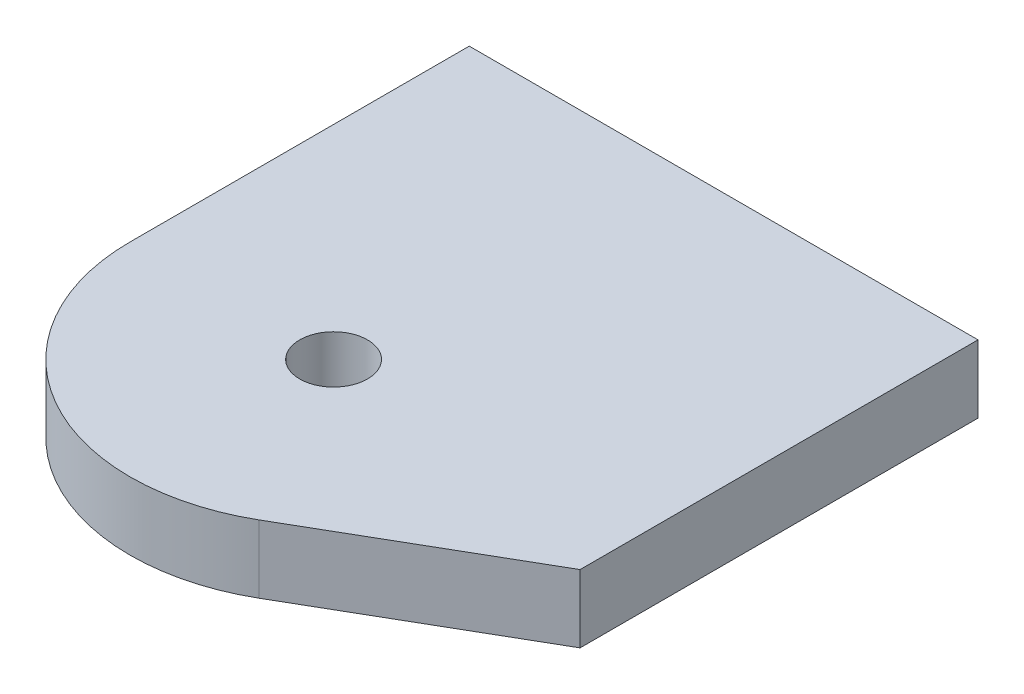
ISO-10303-21;
HEADER;
FILE_DESCRIPTION(('STEP AP214'),'2;1');
FILE_NAME('part.step','',(''),(''),'','','');
FILE_SCHEMA(('AUTOMOTIVE_DESIGN { 1 0 10303 214 1 1 1 1 }'));
ENDSEC;
DATA;
#1=APPLICATION_CONTEXT('core data for automotive mechanical design processes');
#2=APPLICATION_PROTOCOL_DEFINITION('international standard','automotive_design',2000,#1);
#3=PRODUCT_CONTEXT('',#1,'mechanical');
#4=PRODUCT('Part','Part','',(#3));
#5=PRODUCT_RELATED_PRODUCT_CATEGORY('part','',(#4));
#6=PRODUCT_DEFINITION_FORMATION('','',#4);
#7=PRODUCT_DEFINITION_CONTEXT('part definition',#1,'design');
#8=PRODUCT_DEFINITION('design','',#6,#7);
#9=PRODUCT_DEFINITION_SHAPE('','',#8);
#10=(LENGTH_UNIT() NAMED_UNIT(*) SI_UNIT(.MILLI.,.METRE.));
#11=(NAMED_UNIT(*) PLANE_ANGLE_UNIT() SI_UNIT($,.RADIAN.));
#12=(NAMED_UNIT(*) SI_UNIT($,.STERADIAN.) SOLID_ANGLE_UNIT());
#13=UNCERTAINTY_MEASURE_WITH_UNIT(LENGTH_MEASURE(1.E-05),#10,'distance_accuracy_value','');
#14=(GEOMETRIC_REPRESENTATION_CONTEXT(3) GLOBAL_UNCERTAINTY_ASSIGNED_CONTEXT((#13)) GLOBAL_UNIT_ASSIGNED_CONTEXT((#10,
#11,#12)) REPRESENTATION_CONTEXT('',''));
#15=CARTESIAN_POINT('',(0.,0.,0.));
#16=DIRECTION('',(0.,0.,1.));
#17=DIRECTION('',(1.,0.,0.));
#18=AXIS2_PLACEMENT_3D('',#15,#16,#17);
#19=CARTESIAN_POINT('',(0.,2.,0.));
#20=DIRECTION('',(0.,1.,0.));
#21=DIRECTION('',(0.,0.,1.));
#22=AXIS2_PLACEMENT_3D('',#19,#20,#21);
#23=PLANE('',#22);
#24=CARTESIAN_POINT('',(0.,2.,0.));
#25=DIRECTION('',(0.,1.,0.));
#26=DIRECTION('',(0.,0.,1.));
#27=AXIS2_PLACEMENT_3D('',#24,#25,#26);
#28=CIRCLE('',#27,6.);
#29=CARTESIAN_POINT('',(-6.,2.,0.));
#30=VERTEX_POINT('',#29);
#31=CARTESIAN_POINT('',(3.00000000000003,2.,5.19615242270662));
#32=VERTEX_POINT('',#31);
#33=EDGE_CURVE('E121',#30,#32,#28,.T.);
#34=ORIENTED_EDGE('',*,*,#33,.T.);
#35=DIRECTION('',(0.866025403784436,0.,-0.500000000000004));
#36=VECTOR('',#35,1.);
#37=CARTESIAN_POINT('',(3.00000000000003,2.,5.19615242270662));
#38=LINE('',#37,#36);
#39=CARTESIAN_POINT('',(9.,2.,1.73205080756884));
#40=VERTEX_POINT('',#39);
#41=EDGE_CURVE('E88',#32,#40,#38,.T.);
#42=ORIENTED_EDGE('',*,*,#41,.T.);
#43=DIRECTION('',(0.,0.,-1.));
#44=VECTOR('',#43,1.);
#45=CARTESIAN_POINT('',(9.,2.,1.73205080756884));
#46=LINE('',#45,#44);
#47=CARTESIAN_POINT('',(9.,2.,-10.));
#48=VERTEX_POINT('',#47);
#49=EDGE_CURVE('E92',#40,#48,#46,.T.);
#50=ORIENTED_EDGE('',*,*,#49,.T.);
#51=DIRECTION('',(-1.,0.,0.));
#52=VECTOR('',#51,1.);
#53=CARTESIAN_POINT('',(-6.,2.,-10.));
#54=LINE('',#53,#52);
#55=CARTESIAN_POINT('',(-6.,2.,-10.));
#56=VERTEX_POINT('',#55);
#57=EDGE_CURVE('E96',#48,#56,#54,.T.);
#58=ORIENTED_EDGE('',*,*,#57,.T.);
#59=DIRECTION('',(0.,0.,1.));
#60=VECTOR('',#59,1.);
#61=CARTESIAN_POINT('',(-6.,2.,0.));
#62=LINE('',#61,#60);
#63=EDGE_CURVE('E54',#56,#30,#62,.T.);
#64=ORIENTED_EDGE('',*,*,#63,.T.);
#65=EDGE_LOOP('',(#34,#42,#50,#58,#64));
#66=FACE_BOUND('',#65,.T.);
#67=CARTESIAN_POINT('',(0.,2.,0.));
#68=DIRECTION('',(0.,1.,0.));
#69=DIRECTION('',(0.,0.,1.));
#70=AXIS2_PLACEMENT_3D('',#67,#68,#69);
#71=CIRCLE('',#70,1.);
#72=CARTESIAN_POINT('',(0.,2.,1.));
#73=VERTEX_POINT('',#72);
#74=EDGE_CURVE('E116',#73,#73,#71,.T.);
#75=ORIENTED_EDGE('',*,*,#74,.F.);
#76=EDGE_LOOP('',(#75));
#77=FACE_BOUND('',#76,.T.);
#78=ADVANCED_FACE('F37',(#66,#77),#23,.T.);
#79=CARTESIAN_POINT('',(0.,0.,0.));
#80=DIRECTION('',(0.,1.,0.));
#81=DIRECTION('',(0.,0.,1.));
#82=AXIS2_PLACEMENT_3D('',#79,#80,#81);
#83=PLANE('',#82);
#84=CARTESIAN_POINT('',(0.,0.,0.));
#85=DIRECTION('',(0.,1.,0.));
#86=DIRECTION('',(0.,0.,1.));
#87=AXIS2_PLACEMENT_3D('',#84,#85,#86);
#88=CIRCLE('',#87,6.);
#89=CARTESIAN_POINT('',(-6.,0.,0.));
#90=VERTEX_POINT('',#89);
#91=CARTESIAN_POINT('',(3.00000000000003,0.,5.19615242270662));
#92=VERTEX_POINT('',#91);
#93=EDGE_CURVE('E112',#90,#92,#88,.T.);
#94=ORIENTED_EDGE('',*,*,#93,.F.);
#95=DIRECTION('',(0.,0.,1.));
#96=VECTOR('',#95,1.);
#97=CARTESIAN_POINT('',(-6.,0.,0.));
#98=LINE('',#97,#96);
#99=CARTESIAN_POINT('',(-6.,0.,-10.));
#100=VERTEX_POINT('',#99);
#101=EDGE_CURVE('E80',#100,#90,#98,.T.);
#102=ORIENTED_EDGE('',*,*,#101,.F.);
#103=DIRECTION('',(-1.,0.,0.));
#104=VECTOR('',#103,1.);
#105=CARTESIAN_POINT('',(-6.,0.,-10.));
#106=LINE('',#105,#104);
#107=CARTESIAN_POINT('',(9.,0.,-10.));
#108=VERTEX_POINT('',#107);
#109=EDGE_CURVE('E74',#108,#100,#106,.T.);
#110=ORIENTED_EDGE('',*,*,#109,.F.);
#111=DIRECTION('',(0.,0.,-1.));
#112=VECTOR('',#111,1.);
#113=CARTESIAN_POINT('',(9.,0.,1.73205080756884));
#114=LINE('',#113,#112);
#115=CARTESIAN_POINT('',(9.,0.,1.73205080756884));
#116=VERTEX_POINT('',#115);
#117=EDGE_CURVE('E103',#116,#108,#114,.T.);
#118=ORIENTED_EDGE('',*,*,#117,.F.);
#119=DIRECTION('',(0.866025403784436,0.,-0.500000000000004));
#120=VECTOR('',#119,1.);
#121=CARTESIAN_POINT('',(3.00000000000003,0.,5.19615242270662));
#122=LINE('',#121,#120);
#123=EDGE_CURVE('E115',#92,#116,#122,.T.);
#124=ORIENTED_EDGE('',*,*,#123,.F.);
#125=EDGE_LOOP('',(#94,#102,#110,#118,#124));
#126=FACE_BOUND('',#125,.T.);
#127=CARTESIAN_POINT('',(0.,0.,0.));
#128=DIRECTION('',(0.,1.,0.));
#129=DIRECTION('',(0.,0.,1.));
#130=AXIS2_PLACEMENT_3D('',#127,#128,#129);
#131=CIRCLE('',#130,1.);
#132=CARTESIAN_POINT('',(0.,0.,1.));
#133=VERTEX_POINT('',#132);
#134=EDGE_CURVE('E217',#133,#133,#131,.T.);
#135=ORIENTED_EDGE('',*,*,#134,.T.);
#136=EDGE_LOOP('',(#135));
#137=FACE_BOUND('',#136,.T.);
#138=ADVANCED_FACE('F125',(#126,#137),#83,.F.);
#139=CARTESIAN_POINT('',(0.,2.,0.));
#140=DIRECTION('',(0.,-1.,0.));
#141=DIRECTION('',(0.,0.,-1.));
#142=AXIS2_PLACEMENT_3D('',#139,#140,#141);
#143=CYLINDRICAL_SURFACE('',#142,6.);
#144=ORIENTED_EDGE('',*,*,#93,.T.);
#145=DIRECTION('',(0.,-1.,0.));
#146=VECTOR('',#145,1.);
#147=CARTESIAN_POINT('',(3.00000000000003,2.,5.19615242270662));
#148=LINE('',#147,#146);
#149=EDGE_CURVE('E11',#32,#92,#148,.T.);
#150=ORIENTED_EDGE('',*,*,#149,.F.);
#151=ORIENTED_EDGE('',*,*,#33,.F.);
#152=DIRECTION('',(0.,-1.,0.));
#153=VECTOR('',#152,1.);
#154=CARTESIAN_POINT('',(-6.,2.,0.));
#155=LINE('',#154,#153);
#156=EDGE_CURVE('E108',#30,#90,#155,.T.);
#157=ORIENTED_EDGE('',*,*,#156,.T.);
#158=EDGE_LOOP('',(#144,#150,#151,#157));
#159=FACE_BOUND('',#158,.T.);
#160=ADVANCED_FACE('F39',(#159),#143,.T.);
#161=CARTESIAN_POINT('',(3.00000000000003,2.,5.19615242270662));
#162=DIRECTION('',(-0.500000000000004,0.,-0.866025403784436));
#163=DIRECTION('',(-0.866025403784436,0.,0.500000000000005));
#164=AXIS2_PLACEMENT_3D('',#161,#162,#163);
#165=PLANE('',#164);
#166=ORIENTED_EDGE('',*,*,#123,.T.);
#167=DIRECTION('',(0.,-1.,0.));
#168=VECTOR('',#167,1.);
#169=CARTESIAN_POINT('',(9.,2.,1.73205080756884));
#170=LINE('',#169,#168);
#171=EDGE_CURVE('E46',#40,#116,#170,.T.);
#172=ORIENTED_EDGE('',*,*,#171,.F.);
#173=ORIENTED_EDGE('',*,*,#41,.F.);
#174=ORIENTED_EDGE('',*,*,#149,.T.);
#175=EDGE_LOOP('',(#166,#172,#173,#174));
#176=FACE_BOUND('',#175,.T.);
#177=ADVANCED_FACE('F150',(#176),#165,.F.);
#178=CARTESIAN_POINT('',(9.,2.,1.73205080756884));
#179=DIRECTION('',(-1.,0.,0.));
#180=DIRECTION('',(0.,0.,1.));
#181=AXIS2_PLACEMENT_3D('',#178,#179,#180);
#182=PLANE('',#181);
#183=ORIENTED_EDGE('',*,*,#117,.T.);
#184=DIRECTION('',(0.,-1.,0.));
#185=VECTOR('',#184,1.);
#186=CARTESIAN_POINT('',(9.,2.,-10.));
#187=LINE('',#186,#185);
#188=EDGE_CURVE('E100',#48,#108,#187,.T.);
#189=ORIENTED_EDGE('',*,*,#188,.F.);
#190=ORIENTED_EDGE('',*,*,#49,.F.);
#191=ORIENTED_EDGE('',*,*,#171,.T.);
#192=EDGE_LOOP('',(#183,#189,#190,#191));
#193=FACE_BOUND('',#192,.T.);
#194=ADVANCED_FACE('F101',(#193),#182,.F.);
#195=CARTESIAN_POINT('',(-6.,2.,-10.));
#196=DIRECTION('',(0.,0.,1.));
#197=DIRECTION('',(1.,0.,0.));
#198=AXIS2_PLACEMENT_3D('',#195,#196,#197);
#199=PLANE('',#198);
#200=ORIENTED_EDGE('',*,*,#109,.T.);
#201=DIRECTION('',(0.,-1.,0.));
#202=VECTOR('',#201,1.);
#203=CARTESIAN_POINT('',(-6.,2.,-10.));
#204=LINE('',#203,#202);
#205=EDGE_CURVE('E104',#56,#100,#204,.T.);
#206=ORIENTED_EDGE('',*,*,#205,.F.);
#207=ORIENTED_EDGE('',*,*,#57,.F.);
#208=ORIENTED_EDGE('',*,*,#188,.T.);
#209=EDGE_LOOP('',(#200,#206,#207,#208));
#210=FACE_BOUND('',#209,.T.);
#211=ADVANCED_FACE('F106',(#210),#199,.F.);
#212=CARTESIAN_POINT('',(-6.,2.,0.));
#213=DIRECTION('',(1.,0.,0.));
#214=DIRECTION('',(0.,0.,-1.));
#215=AXIS2_PLACEMENT_3D('',#212,#213,#214);
#216=PLANE('',#215);
#217=ORIENTED_EDGE('',*,*,#101,.T.);
#218=ORIENTED_EDGE('',*,*,#156,.F.);
#219=ORIENTED_EDGE('',*,*,#63,.F.);
#220=ORIENTED_EDGE('',*,*,#205,.T.);
#221=EDGE_LOOP('',(#217,#218,#219,#220));
#222=FACE_BOUND('',#221,.T.);
#223=ADVANCED_FACE('F130',(#222),#216,.F.);
#224=CARTESIAN_POINT('',(0.,2.,0.));
#225=DIRECTION('',(0.,-1.,0.));
#226=DIRECTION('',(0.,0.,-1.));
#227=AXIS2_PLACEMENT_3D('',#224,#225,#226);
#228=CYLINDRICAL_SURFACE('',#227,1.);
#229=ORIENTED_EDGE('',*,*,#74,.T.);
#230=EDGE_LOOP('',(#229));
#231=FACE_BOUND('',#230,.T.);
#232=ORIENTED_EDGE('',*,*,#134,.F.);
#233=EDGE_LOOP('',(#232));
#234=FACE_BOUND('',#233,.T.);
#235=ADVANCED_FACE('F132',(#231,#234),#228,.F.);
#236=CLOSED_SHELL('',(#78,#138,#160,#177,#194,#211,#223,#235));
#237=MANIFOLD_SOLID_BREP('B2',#236);
#238=ADVANCED_BREP_SHAPE_REPRESENTATION('',(#18,#237),#14);
#239=SHAPE_DEFINITION_REPRESENTATION(#9,#238);
ENDSEC;
END-ISO-10303-21;
